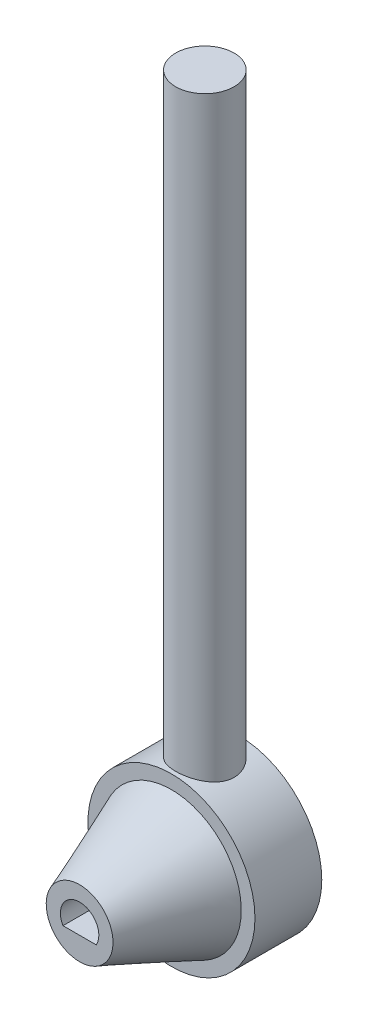
ISO-10303-21;
HEADER;
FILE_DESCRIPTION(('STEP AP214'),'2;1');
FILE_NAME('part.step','',(''),(''),'','','');
FILE_SCHEMA(('AUTOMOTIVE_DESIGN { 1 0 10303 214 1 1 1 1 }'));
ENDSEC;
DATA;
#1=APPLICATION_CONTEXT('core data for automotive mechanical design processes');
#2=APPLICATION_PROTOCOL_DEFINITION('international standard','automotive_design',2000,#1);
#3=PRODUCT_CONTEXT('',#1,'mechanical');
#4=PRODUCT('Part','Part','',(#3));
#5=PRODUCT_RELATED_PRODUCT_CATEGORY('part','',(#4));
#6=PRODUCT_DEFINITION_FORMATION('','',#4);
#7=PRODUCT_DEFINITION_CONTEXT('part definition',#1,'design');
#8=PRODUCT_DEFINITION('design','',#6,#7);
#9=PRODUCT_DEFINITION_SHAPE('','',#8);
#10=(LENGTH_UNIT() NAMED_UNIT(*) SI_UNIT(.MILLI.,.METRE.));
#11=(NAMED_UNIT(*) PLANE_ANGLE_UNIT() SI_UNIT($,.RADIAN.));
#12=(NAMED_UNIT(*) SI_UNIT($,.STERADIAN.) SOLID_ANGLE_UNIT());
#13=UNCERTAINTY_MEASURE_WITH_UNIT(LENGTH_MEASURE(1.E-05),#10,'distance_accuracy_value','');
#14=(GEOMETRIC_REPRESENTATION_CONTEXT(3) GLOBAL_UNCERTAINTY_ASSIGNED_CONTEXT((#13)) GLOBAL_UNIT_ASSIGNED_CONTEXT((#10,
#11,#12)) REPRESENTATION_CONTEXT('',''));
#15=CARTESIAN_POINT('',(0.,0.,0.));
#16=DIRECTION('',(0.,0.,1.));
#17=DIRECTION('',(1.,0.,0.));
#18=AXIS2_PLACEMENT_3D('',#15,#16,#17);
#19=CARTESIAN_POINT('',(0.,90.,0.));
#20=DIRECTION('',(0.,-1.,0.));
#21=DIRECTION('',(0.,0.,-1.));
#22=AXIS2_PLACEMENT_3D('',#19,#20,#21);
#23=CYLINDRICAL_SURFACE('',#22,3.5);
#24=CARTESIAN_POINT('',(0.,90.,0.));
#25=DIRECTION('',(0.,1.,0.));
#26=DIRECTION('',(0.,0.,1.));
#27=AXIS2_PLACEMENT_3D('',#24,#25,#26);
#28=CIRCLE('',#27,3.5);
#29=CARTESIAN_POINT('',(0.,90.,3.5));
#30=VERTEX_POINT('',#29);
#31=EDGE_CURVE('E137',#30,#30,#28,.T.);
#32=ORIENTED_EDGE('',*,*,#31,.F.);
#33=EDGE_LOOP('',(#32));
#34=FACE_BOUND('',#33,.T.);
#35=CARTESIAN_POINT('',(3.5,18.3674969975976,0.));
#36=CARTESIAN_POINT('',(3.49999931876293,18.3674974163581,0.0949125445487518));
#37=CARTESIAN_POINT('',(3.49613335325264,18.3689450925432,0.189827733414717));
#38=CARTESIAN_POINT('',(3.48072025667604,18.3746808559934,0.378954929942532));
#39=CARTESIAN_POINT('',(3.46917030321874,18.3789699869454,0.473166666357867));
#40=CARTESIAN_POINT('',(3.42308456090508,18.3959384206346,0.753922053444382));
#41=CARTESIAN_POINT('',(3.3771130257858,18.4127185574715,0.938482679515707));
#42=CARTESIAN_POINT('',(3.25660142901521,18.4550802797245,1.29620574896545));
#43=CARTESIAN_POINT('',(3.18214019853367,18.4806375589245,1.46939811280679));
#44=CARTESIAN_POINT('',(3.00699224393094,18.5376336459777,1.8008678718889));
#45=CARTESIAN_POINT('',(2.90630701540706,18.569072118388,1.95914611700533));
#46=CARTESIAN_POINT('',(2.67688564764853,18.6358225235968,2.26317720861855));
#47=CARTESIAN_POINT('',(2.54720110491909,18.6712382320074,2.40819147403998));
#48=CARTESIAN_POINT('',(2.2654765222467,18.7410808991136,2.67493099739407));
#49=CARTESIAN_POINT('',(2.11343139872121,18.7755076308365,2.79665094494343));
#50=CARTESIAN_POINT('',(1.78584991632491,18.8407006035732,3.01675048103769));
#51=CARTESIAN_POINT('',(1.60975902782438,18.8713312920524,3.11434843953507));
#52=CARTESIAN_POINT('',(1.24240084860165,18.9242536724353,3.27823977332488));
#53=CARTESIAN_POINT('',(1.05113816356763,18.946547883382,3.34454260669185));
#54=CARTESIAN_POINT('',(0.666588873402089,18.9795523447277,3.44143359484431));
#55=CARTESIAN_POINT('',(0.473656222959584,18.9906711074492,3.47328476251692));
#56=CARTESIAN_POINT('',(0.0848855770757777,19.0015281482889,3.50439616107746));
#57=CARTESIAN_POINT('',(-0.110951578274,19.001269655351,3.50366563887367));
#58=CARTESIAN_POINT('',(-0.490988185550729,18.9896716618838,3.47041045325108));
#59=CARTESIAN_POINT('',(-0.675324978968535,18.9788111922274,3.43926022663317));
#60=CARTESIAN_POINT('',(-1.03596787992006,18.9478412300132,3.34833704725335));
#61=CARTESIAN_POINT('',(-1.21227340064587,18.9277310628101,3.28856200667053));
#62=CARTESIAN_POINT('',(-1.55471880066635,18.8799381735561,3.14134942844472));
#63=CARTESIAN_POINT('',(-1.72068479372725,18.8521547684702,3.05354148905649));
#64=CARTESIAN_POINT('',(-2.03590938344228,18.791877409622,2.85306499815619));
#65=CARTESIAN_POINT('',(-2.18516381692522,18.7593822866869,2.74039027252758));
#66=CARTESIAN_POINT('',(-2.47085266041279,18.6911078532,2.48661691576681));
#67=CARTESIAN_POINT('',(-2.60623320305309,18.6552455874217,2.34435462295479));
#68=CARTESIAN_POINT('',(-2.85166653148397,18.5856309669504,2.03871855007066));
#69=CARTESIAN_POINT('',(-2.96170630774453,18.551879702458,1.87533399308184));
#70=CARTESIAN_POINT('',(-3.10615110190286,18.5054953965972,1.61613336808647));
#71=CARTESIAN_POINT('',(-3.15118056912875,18.4906240557175,1.52648340753314));
#72=CARTESIAN_POINT('',(-3.23347084778299,18.4629040138808,1.34339922032142));
#73=CARTESIAN_POINT('',(-3.27073492418945,18.4500544634159,1.24996660390456));
#74=CARTESIAN_POINT('',(-3.33709936439097,18.4268236156629,1.06012560819917));
#75=CARTESIAN_POINT('',(-3.36621302024361,18.416438303855,0.963722362006856));
#76=CARTESIAN_POINT('',(-3.41605853619604,18.3984704797763,0.768557216860319));
#77=CARTESIAN_POINT('',(-3.43679422950909,18.3908866858486,0.669796418525072));
#78=CARTESIAN_POINT('',(-3.46877041331216,18.379120718024,0.476156346132637));
#79=CARTESIAN_POINT('',(-3.48047090109223,18.37477422283,0.381362811146862));
#80=CARTESIAN_POINT('',(-3.49608605186955,18.368962146477,0.191047078779583));
#81=CARTESIAN_POINT('',(-3.50000068563212,18.3674965761354,0.0955248786634047));
#82=CARTESIAN_POINT('',(-3.49999931876293,18.3674974163581,-0.0949125445487516));
#83=CARTESIAN_POINT('',(-3.49613335325264,18.3689450925432,-0.189827733414716));
#84=CARTESIAN_POINT('',(-3.48072025667604,18.3746808559934,-0.378954929942532));
#85=CARTESIAN_POINT('',(-3.46917030321874,18.3789699869454,-0.473166666357867));
#86=CARTESIAN_POINT('',(-3.42308456090508,18.3959384206346,-0.753922053444383));
#87=CARTESIAN_POINT('',(-3.3771130257858,18.4127185574715,-0.938482679515707));
#88=CARTESIAN_POINT('',(-3.25660142901521,18.4550802797245,-1.29620574896545));
#89=CARTESIAN_POINT('',(-3.18214019853367,18.4806375589245,-1.46939811280679));
#90=CARTESIAN_POINT('',(-3.00699224393094,18.5376336459777,-1.8008678718889));
#91=CARTESIAN_POINT('',(-2.90630701540706,18.569072118388,-1.95914611700533));
#92=CARTESIAN_POINT('',(-2.67688564764853,18.6358225235968,-2.26317720861855));
#93=CARTESIAN_POINT('',(-2.54720110491909,18.6712382320074,-2.40819147403998));
#94=CARTESIAN_POINT('',(-2.2654765222467,18.7410808991136,-2.67493099739407));
#95=CARTESIAN_POINT('',(-2.11343139872121,18.7755076308365,-2.79665094494343));
#96=CARTESIAN_POINT('',(-1.78584991632491,18.8407006035732,-3.01675048103769));
#97=CARTESIAN_POINT('',(-1.60975902782438,18.8713312920524,-3.11434843953507));
#98=CARTESIAN_POINT('',(-1.24240084860165,18.9242536724353,-3.27823977332488));
#99=CARTESIAN_POINT('',(-1.05113816356763,18.946547883382,-3.34454260669185));
#100=CARTESIAN_POINT('',(-0.666588873402089,18.9795523447277,-3.44143359484431));
#101=CARTESIAN_POINT('',(-0.473656222959583,18.9906711074492,-3.47328476251692));
#102=CARTESIAN_POINT('',(-0.0848855770757767,19.0015281482889,-3.50439616107746));
#103=CARTESIAN_POINT('',(0.110951578274001,19.001269655351,-3.50366563887367));
#104=CARTESIAN_POINT('',(0.490988185550729,18.9896716618838,-3.47041045325108));
#105=CARTESIAN_POINT('',(0.675324978968537,18.9788111922274,-3.43926022663317));
#106=CARTESIAN_POINT('',(1.03596787992007,18.9478412300132,-3.34833704725335));
#107=CARTESIAN_POINT('',(1.21227340064587,18.9277310628101,-3.28856200667053));
#108=CARTESIAN_POINT('',(1.55471880066635,18.8799381735561,-3.14134942844472));
#109=CARTESIAN_POINT('',(1.72068479372725,18.8521547684702,-3.05354148905649));
#110=CARTESIAN_POINT('',(2.03590938344228,18.791877409622,-2.85306499815618));
#111=CARTESIAN_POINT('',(2.18516381692522,18.7593822866869,-2.74039027252758));
#112=CARTESIAN_POINT('',(2.47085266041279,18.6911078532,-2.48661691576682));
#113=CARTESIAN_POINT('',(2.60623320305308,18.6552455874217,-2.34435462295479));
#114=CARTESIAN_POINT('',(2.85166653148397,18.5856309669504,-2.03871855007066));
#115=CARTESIAN_POINT('',(2.96170630774453,18.551879702458,-1.87533399308184));
#116=CARTESIAN_POINT('',(3.10615110190286,18.5054953965972,-1.61613336808647));
#117=CARTESIAN_POINT('',(3.15118056912875,18.4906240557175,-1.52648340753314));
#118=CARTESIAN_POINT('',(3.23347084778299,18.4629040138808,-1.34339922032142));
#119=CARTESIAN_POINT('',(3.27073492418945,18.4500544634159,-1.24996660390456));
#120=CARTESIAN_POINT('',(3.33709936439097,18.4268236156629,-1.06012560819917));
#121=CARTESIAN_POINT('',(3.36621302024361,18.416438303855,-0.963722362006855));
#122=CARTESIAN_POINT('',(3.41605853619604,18.3984704797763,-0.768557216860318));
#123=CARTESIAN_POINT('',(3.43679422950909,18.3908866858487,-0.669796418525071));
#124=CARTESIAN_POINT('',(3.46877041331216,18.3791207180239,-0.476156346132637));
#125=CARTESIAN_POINT('',(3.48047090109223,18.37477422283,-0.381362811146862));
#126=CARTESIAN_POINT('',(3.49608605186955,18.368962146477,-0.191047078779582));
#127=CARTESIAN_POINT('',(3.50000068563212,18.3674965761354,-0.0955248786634045));
#128=CARTESIAN_POINT('',(3.5,18.3674969975976,0.));
#129=B_SPLINE_CURVE_WITH_KNOTS('',3,(#35,#36,#37,#38,#39,#40,#41,#42,#43,#44,#45,#46,#47,#48,
#49,#50,#51,#52,#53,#54,#55,#56,#57,#58,#59,#60,#61,#62,#63,#64,#65,#66,#67,#68,#69,#70,#71,#72,
#73,#74,#75,#76,#77,#78,#79,#80,#81,#82,#83,#84,#85,#86,#87,#88,#89,#90,#91,#92,#93,#94,#95,#96,
#97,#98,#99,#100,#101,#102,#103,#104,#105,#106,#107,#108,#109,#110,#111,#112,#113,#114,#115,
#116,#117,#118,#119,#120,#121,#122,#123,#124,#125,#126,#127,#128),.UNSPECIFIED.,.T.,.F.,(4,2,2,
2,2,2,2,2,2,2,2,2,2,2,2,2,2,2,2,2,2,2,2,2,2,2,2,2,2,2,2,2,2,2,2,2,2,2,2,2,2,2,2,2,2,2,4),(0.,
0.284642016105157,0.569388641293585,1.13918738851407,1.70742076956042,2.2756217504256,
2.86619565394675,3.45690403007573,4.06478943625891,4.67249100829415,5.25706829163205,
5.8414796689613,6.40065242591722,6.95986597372056,7.52679758954604,8.09387012618269,
8.69010214839508,9.2866395872469,9.59057721468944,9.89438679179854,10.1976979778488,
10.5008702307562,10.7873475566466,11.0738259582132,11.3584679743184,11.6432145995068,
12.2130133467273,12.7812467277737,13.3494477086388,13.94002161216,14.530729988289,
15.1386153944721,15.7463169665074,16.3308942498453,16.9153056271745,17.4744783841305,
18.0336919319338,18.6006235477593,19.1676960843959,19.7639281066083,20.3604655454601,
20.6644031729027,20.9682127500118,21.271523936062,21.5746961889695,21.8611735148598,
22.1476519164265),.UNSPECIFIED.);
#130=CARTESIAN_POINT('',(3.5,18.3674969975976,0.));
#131=VERTEX_POINT('',#130);
#132=EDGE_CURVE('E40',#131,#131,#129,.T.);
#133=ORIENTED_EDGE('',*,*,#132,.F.);
#134=EDGE_LOOP('',(#133));
#135=FACE_BOUND('',#134,.T.);
#136=ADVANCED_FACE('F36',(#34,#135),#23,.T.);
#137=CARTESIAN_POINT('',(0.,90.,0.));
#138=DIRECTION('',(0.,1.,0.));
#139=DIRECTION('',(0.,0.,1.));
#140=AXIS2_PLACEMENT_3D('',#137,#138,#139);
#141=PLANE('',#140);
#142=ORIENTED_EDGE('',*,*,#31,.T.);
#143=EDGE_LOOP('',(#142));
#144=FACE_BOUND('',#143,.T.);
#145=ADVANCED_FACE('F148',(#144),#141,.T.);
#146=CARTESIAN_POINT('',(0.,9.,4.));
#147=DIRECTION('',(0.,0.,-1.));
#148=DIRECTION('',(-1.,0.,0.));
#149=AXIS2_PLACEMENT_3D('',#146,#147,#148);
#150=CYLINDRICAL_SURFACE('',#149,10.);
#151=CARTESIAN_POINT('',(0.,9.,4.));
#152=DIRECTION('',(0.,0.,1.));
#153=DIRECTION('',(1.,0.,0.));
#154=AXIS2_PLACEMENT_3D('',#151,#152,#153);
#155=CIRCLE('',#154,10.);
#156=CARTESIAN_POINT('',(10.,9.,4.));
#157=VERTEX_POINT('',#156);
#158=EDGE_CURVE('E134',#157,#157,#155,.T.);
#159=ORIENTED_EDGE('',*,*,#158,.F.);
#160=EDGE_LOOP('',(#159));
#161=FACE_BOUND('',#160,.T.);
#162=ORIENTED_EDGE('',*,*,#132,.T.);
#163=EDGE_LOOP('',(#162));
#164=FACE_BOUND('',#163,.T.);
#165=CARTESIAN_POINT('',(0.,9.,-4.));
#166=DIRECTION('',(0.,0.,1.));
#167=DIRECTION('',(1.,0.,0.));
#168=AXIS2_PLACEMENT_3D('',#165,#166,#167);
#169=CIRCLE('',#168,10.);
#170=CARTESIAN_POINT('',(10.,9.,-4.));
#171=VERTEX_POINT('',#170);
#172=EDGE_CURVE('E129',#171,#171,#169,.T.);
#173=ORIENTED_EDGE('',*,*,#172,.T.);
#174=EDGE_LOOP('',(#173));
#175=FACE_BOUND('',#174,.T.);
#176=ADVANCED_FACE('F144',(#161,#164,#175),#150,.T.);
#177=CARTESIAN_POINT('',(0.,9.,4.));
#178=DIRECTION('',(0.,0.,1.));
#179=DIRECTION('',(1.,0.,0.));
#180=AXIS2_PLACEMENT_3D('',#177,#178,#179);
#181=PLANE('',#180);
#182=CARTESIAN_POINT('',(0.,9.,4.));
#183=DIRECTION('',(0.,0.,1.));
#184=DIRECTION('',(1.,0.,0.));
#185=AXIS2_PLACEMENT_3D('',#182,#183,#184);
#186=CIRCLE('',#185,8.35855926568982);
#187=CARTESIAN_POINT('',(-8.3533591605789,9.29479439007853,4.));
#188=VERTEX_POINT('',#187);
#189=EDGE_CURVE('E12',#188,#188,#186,.T.);
#190=ORIENTED_EDGE('',*,*,#189,.F.);
#191=EDGE_LOOP('',(#190));
#192=FACE_BOUND('',#191,.T.);
#193=ORIENTED_EDGE('',*,*,#158,.T.);
#194=EDGE_LOOP('',(#193));
#195=FACE_BOUND('',#194,.T.);
#196=ADVANCED_FACE('F156',(#192,#195),#181,.T.);
#197=CARTESIAN_POINT('',(0.,9.,-4.));
#198=DIRECTION('',(0.,0.,1.));
#199=DIRECTION('',(1.,0.,0.));
#200=AXIS2_PLACEMENT_3D('',#197,#198,#199);
#201=PLANE('',#200);
#202=ORIENTED_EDGE('',*,*,#172,.F.);
#203=EDGE_LOOP('',(#202));
#204=FACE_BOUND('',#203,.T.);
#205=ADVANCED_FACE('F118',(#204),#201,.F.);
#206=CARTESIAN_POINT('',(0.,9.,15.));
#207=DIRECTION('',(0.,0.,1.));
#208=DIRECTION('',(1.,0.,0.));
#209=AXIS2_PLACEMENT_3D('',#206,#207,#208);
#210=PLANE('',#209);
#211=CARTESIAN_POINT('',(0.,8.90005068199067,15.));
#212=DIRECTION('',(0.,0.,1.));
#213=DIRECTION('',(1.,0.,0.));
#214=AXIS2_PLACEMENT_3D('',#211,#212,#213);
#215=CIRCLE('',#214,2.3);
#216=CARTESIAN_POINT('',(1.99219481952629,7.75063352488337,15.));
#217=VERTEX_POINT('',#216);
#218=CARTESIAN_POINT('',(-1.99219481952629,7.75063352488337,15.));
#219=VERTEX_POINT('',#218);
#220=EDGE_CURVE('E55',#217,#219,#215,.T.);
#221=ORIENTED_EDGE('',*,*,#220,.F.);
#222=DIRECTION('',(-1.,0.,0.));
#223=VECTOR('',#222,1.);
#224=CARTESIAN_POINT('',(1.99219481952629,7.75063352488337,15.));
#225=LINE('',#224,#223);
#226=EDGE_CURVE('E75',#217,#219,#225,.T.);
#227=ORIENTED_EDGE('',*,*,#226,.T.);
#228=EDGE_LOOP('',(#221,#227));
#229=FACE_BOUND('',#228,.T.);
#230=CARTESIAN_POINT('',(0.,9.,15.));
#231=DIRECTION('',(0.,0.,1.));
#232=DIRECTION('',(1.,0.,0.));
#233=AXIS2_PLACEMENT_3D('',#230,#231,#232);
#234=CIRCLE('',#233,4.);
#235=CARTESIAN_POINT('',(-3.89810749114631,8.10291695620248,15.));
#236=VERTEX_POINT('',#235);
#237=EDGE_CURVE('E71',#236,#236,#234,.T.);
#238=ORIENTED_EDGE('',*,*,#237,.T.);
#239=EDGE_LOOP('',(#238));
#240=FACE_BOUND('',#239,.T.);
#241=ADVANCED_FACE('F79',(#229,#240),#210,.T.);
#242=CARTESIAN_POINT('',(-9.9734506767362,9.72820436603346,0.));
#243=CARTESIAN_POINT('',(-3.89810749114631,8.10291695620248,15.));
#244=CARTESIAN_POINT('',(-11.4298594088031,-10.2186969874389,0.));
#245=CARTESIAN_POINT('',(-2.10394140355126,0.306701973909855,15.));
#246=CARTESIAN_POINT('',(8.51704194466928,-11.6751057195059,0.));
#247=CARTESIAN_POINT('',(5.69227357874136,2.1008680615049,15.));
#248=CARTESIAN_POINT('',(9.9734506767362,8.27179563396654,0.));
#249=CARTESIAN_POINT('',(3.89810749114631,9.89708304379752,15.));
#250=CARTESIAN_POINT('',(11.4298594088031,28.2186969874389,0.));
#251=CARTESIAN_POINT('',(2.10394140355126,17.6932980260901,15.));
#252=CARTESIAN_POINT('',(-8.51704194466928,29.6751057195059,0.));
#253=CARTESIAN_POINT('',(-5.69227357874136,15.8991319384951,15.));
#254=CARTESIAN_POINT('',(-9.9734506767362,9.72820436603346,0.));
#255=CARTESIAN_POINT('',(-3.89810749114631,8.10291695620248,15.));
#256=(BOUNDED_SURFACE() B_SPLINE_SURFACE(3,1,((#242,#243),(#244,#245),(#246,#247),(#248,#249),
(#250,#251),(#252,#253),(#254,#255)),.UNSPECIFIED.,.T.,.F.,.F.) B_SPLINE_SURFACE_WITH_KNOTS((4,
3,4),(2,2),(0.,0.5,1.),(0.,1.),
.UNSPECIFIED.) GEOMETRIC_REPRESENTATION_ITEM() RATIONAL_B_SPLINE_SURFACE(((1.,1.),
(0.333333333333333,0.333333333333333),(0.333333333333333,0.333333333333333),(1.,1.),
(0.333333333333333,0.333333333333333),(0.333333333333333,0.333333333333333),(1.,1.))) REPRESENTATION_ITEM('') SURFACE());
#257=CARTESIAN_POINT('',(-8.3533591605789,9.29479439007853,4.));
#258=CARTESIAN_POINT('',(-8.30695028902231,9.28237900014232,4.11458333333333));
#259=CARTESIAN_POINT('',(-8.26054141746572,9.26996361020611,4.22916666666667));
#260=CARTESIAN_POINT('',(-8.16772367435254,9.24513283033369,4.45833333333333));
#261=CARTESIAN_POINT('',(-8.12131480279595,9.23271744039748,4.57291666666667));
#262=CARTESIAN_POINT('',(-8.02849705968277,9.20788666052507,4.80208333333333));
#263=CARTESIAN_POINT('',(-7.98208818812618,9.19547127058886,4.91666666666667));
#264=CARTESIAN_POINT('',(-7.889270445013,9.17064049071644,5.14583333333333));
#265=CARTESIAN_POINT('',(-7.84286157345641,9.15822510078023,5.26041666666667));
#266=CARTESIAN_POINT('',(-7.75004383034323,9.13339432090781,5.48958333333333));
#267=CARTESIAN_POINT('',(-7.70363495878665,9.1209789309716,5.60416666666667));
#268=CARTESIAN_POINT('',(-7.61081721567347,9.09614815109919,5.83333333333333));
#269=CARTESIAN_POINT('',(-7.56440834411688,9.08373276116298,5.94791666666667));
#270=CARTESIAN_POINT('',(-7.4715906010037,9.05890198129056,6.17708333333333));
#271=CARTESIAN_POINT('',(-7.42518172944711,9.04648659135435,6.29166666666667));
#272=CARTESIAN_POINT('',(-7.33236398633393,9.02165581148193,6.52083333333333));
#273=CARTESIAN_POINT('',(-7.28595511477734,9.00924042154572,6.63541666666667));
#274=CARTESIAN_POINT('',(-7.19313737166416,8.98440964167331,6.86458333333333));
#275=CARTESIAN_POINT('',(-7.14672850010757,8.9719942517371,6.97916666666667));
#276=CARTESIAN_POINT('',(-7.05391075699439,8.94716347186468,7.20833333333333));
#277=CARTESIAN_POINT('',(-7.0075018854378,8.93474808192847,7.32291666666667));
#278=CARTESIAN_POINT('',(-6.91468414232462,8.90991730205605,7.55208333333333));
#279=CARTESIAN_POINT('',(-6.86827527076803,8.89750191211984,7.66666666666667));
#280=CARTESIAN_POINT('',(-6.77545752765486,8.87267113224743,7.89583333333333));
#281=CARTESIAN_POINT('',(-6.72904865609827,8.86025574231122,8.01041666666667));
#282=CARTESIAN_POINT('',(-6.63623091298509,8.8354249624388,8.23958333333333));
#283=CARTESIAN_POINT('',(-6.5898220414285,8.82300957250259,8.35416666666667));
#284=CARTESIAN_POINT('',(-6.49700429831532,8.79817879263017,8.58333333333333));
#285=CARTESIAN_POINT('',(-6.45059542675873,8.78576340269396,8.69791666666667));
#286=CARTESIAN_POINT('',(-6.35777768364555,8.76093262282155,8.92708333333333));
#287=CARTESIAN_POINT('',(-6.31136881208896,8.74851723288534,9.04166666666667));
#288=CARTESIAN_POINT('',(-6.21855106897578,8.72368645301292,9.27083333333333));
#289=CARTESIAN_POINT('',(-6.17214219741919,8.71127106307671,9.38541666666667));
#290=CARTESIAN_POINT('',(-6.07932445430601,8.68644028320429,9.61458333333333));
#291=CARTESIAN_POINT('',(-6.03291558274942,8.67402489326808,9.72916666666667));
#292=CARTESIAN_POINT('',(-5.94009783963625,8.64919411339567,9.95833333333333));
#293=CARTESIAN_POINT('',(-5.89368896807965,8.63677872345946,10.0729166666667));
#294=CARTESIAN_POINT('',(-5.80087122496648,8.61194794358704,10.3020833333333));
#295=CARTESIAN_POINT('',(-5.75446235340989,8.59953255365083,10.4166666666667));
#296=CARTESIAN_POINT('',(-5.66164461029671,8.57470177377841,10.6458333333333));
#297=CARTESIAN_POINT('',(-5.61523573874012,8.5622863838422,10.7604166666667));
#298=CARTESIAN_POINT('',(-5.52241799562694,8.53745560396979,10.9895833333333));
#299=CARTESIAN_POINT('',(-5.47600912407035,8.52504021403358,11.1041666666667));
#300=CARTESIAN_POINT('',(-5.38319138095717,8.50020943416116,11.3333333333333));
#301=CARTESIAN_POINT('',(-5.33678250940058,8.48779404422495,11.4479166666667));
#302=CARTESIAN_POINT('',(-5.2439647662874,8.46296326435253,11.6770833333333));
#303=CARTESIAN_POINT('',(-5.19755589473081,8.45054787441632,11.7916666666667));
#304=CARTESIAN_POINT('',(-5.10473815161764,8.42571709454391,12.0208333333333));
#305=CARTESIAN_POINT('',(-5.05832928006105,8.4133017046077,12.1354166666667));
#306=CARTESIAN_POINT('',(-4.96551153694787,8.38847092473528,12.3645833333333));
#307=CARTESIAN_POINT('',(-4.91910266539128,8.37605553479907,12.4791666666667));
#308=CARTESIAN_POINT('',(-4.8262849222781,8.35122475492665,12.7083333333333));
#309=CARTESIAN_POINT('',(-4.77987605072151,8.33880936499044,12.8229166666667));
#310=CARTESIAN_POINT('',(-4.68705830760833,8.31397858511803,13.0520833333333));
#311=CARTESIAN_POINT('',(-4.64064943605174,8.30156319518182,13.1666666666667));
#312=CARTESIAN_POINT('',(-4.54783169293856,8.2767324153094,13.3958333333333));
#313=CARTESIAN_POINT('',(-4.50142282138197,8.26431702537319,13.5104166666667));
#314=CARTESIAN_POINT('',(-4.40860507826879,8.23948624550077,13.7395833333333));
#315=CARTESIAN_POINT('',(-4.3621962067122,8.22707085556456,13.8541666666667));
#316=CARTESIAN_POINT('',(-4.26937846359902,8.20224007569215,14.0833333333333));
#317=CARTESIAN_POINT('',(-4.22296959204244,8.18982468575594,14.1979166666667));
#318=CARTESIAN_POINT('',(-4.13015184892926,8.16499390588352,14.4270833333333));
#319=CARTESIAN_POINT('',(-4.08374297737267,8.15257851594731,14.5416666666667));
#320=CARTESIAN_POINT('',(-3.99092523425949,8.12774773607489,14.7708333333333));
#321=CARTESIAN_POINT('',(-3.9445163627029,8.11533234613868,14.8854166666667));
#322=CARTESIAN_POINT('',(-3.89810749114631,8.10291695620248,15.));
#323=B_SPLINE_CURVE_WITH_KNOTS('',3,(#257,#258,#259,#260,#261,#262,#263,#264,#265,#266,#267,
#268,#269,#270,#271,#272,#273,#274,#275,#276,#277,#278,#279,#280,#281,#282,#283,#284,#285,#286,
#287,#288,#289,#290,#291,#292,#293,#294,#295,#296,#297,#298,#299,#300,#301,#302,#303,#304,#305,
#306,#307,#308,#309,#310,#311,#312,#313,#314,#315,#316,#317,#318,#319,#320,#321,#322),
.UNSPECIFIED.,.F.,.F.,(4,2,2,2,2,2,2,2,2,2,2,2,2,2,2,2,2,2,2,2,2,2,2,2,2,2,2,2,2,2,2,2,4),(0.,
0.372740378679071,0.745480757358142,1.11822113603721,1.49096151471628,1.86370189339535,
2.23644227207443,2.6091826507535,2.98192302943257,3.35466340811164,3.72740378679071,
4.10014416546978,4.47288454414885,4.84562492282792,5.21836530150699,5.59110568018606,
5.96384605886513,6.33658643754421,6.70932681622328,7.08206719490235,7.45480757358142,
7.82754795226049,8.20028833093956,8.57302870961863,8.9457690882977,9.31850946697677,
9.69124984565584,10.0639902243349,10.436730603014,10.8094709816931,11.1822113603721,
11.5549517390512,11.9276921177303),.UNSPECIFIED.);
#324=EDGE_CURVE('BSEAM96',#188,#236,#323,.T.);
#325=ORIENTED_EDGE('',*,*,#189,.T.);
#326=ORIENTED_EDGE('',*,*,#237,.F.);
#327=ORIENTED_EDGE('',*,*,#324,.T.);
#328=ORIENTED_EDGE('',*,*,#324,.F.);
#329=EDGE_LOOP('',(#325,#327,#326,#328));
#330=FACE_BOUND('',#329,.T.);
#331=ADVANCED_FACE('F96',(#330),#256,.T.);
#332=CARTESIAN_POINT('',(0.,8.90005068199067,8.5));
#333=DIRECTION('',(0.,0.,1.));
#334=DIRECTION('',(1.,0.,0.));
#335=AXIS2_PLACEMENT_3D('',#332,#333,#334);
#336=CYLINDRICAL_SURFACE('',#335,2.3);
#337=ORIENTED_EDGE('',*,*,#220,.T.);
#338=DIRECTION('',(0.,0.,1.));
#339=VECTOR('',#338,1.);
#340=CARTESIAN_POINT('',(-1.99219481952629,7.75063352488337,8.5));
#341=LINE('',#340,#339);
#342=CARTESIAN_POINT('',(-1.99219481952629,7.75063352488337,8.5));
#343=VERTEX_POINT('',#342);
#344=EDGE_CURVE('E72',#343,#219,#341,.T.);
#345=ORIENTED_EDGE('',*,*,#344,.F.);
#346=CARTESIAN_POINT('',(0.,8.90005068199067,8.5));
#347=DIRECTION('',(0.,0.,1.));
#348=DIRECTION('',(1.,0.,0.));
#349=AXIS2_PLACEMENT_3D('',#346,#347,#348);
#350=CIRCLE('',#349,2.3);
#351=CARTESIAN_POINT('',(1.99219481952629,7.75063352488337,8.5));
#352=VERTEX_POINT('',#351);
#353=EDGE_CURVE('E70',#352,#343,#350,.T.);
#354=ORIENTED_EDGE('',*,*,#353,.F.);
#355=DIRECTION('',(0.,0.,1.));
#356=VECTOR('',#355,1.);
#357=CARTESIAN_POINT('',(1.99219481952629,7.75063352488337,8.5));
#358=LINE('',#357,#356);
#359=EDGE_CURVE('E63',#352,#217,#358,.T.);
#360=ORIENTED_EDGE('',*,*,#359,.T.);
#361=EDGE_LOOP('',(#337,#345,#354,#360));
#362=FACE_BOUND('',#361,.T.);
#363=ADVANCED_FACE('F68',(#362),#336,.F.);
#364=CARTESIAN_POINT('',(1.99219481952629,7.75063352488337,8.5));
#365=DIRECTION('',(0.,1.,0.));
#366=DIRECTION('',(-1.,0.,0.));
#367=AXIS2_PLACEMENT_3D('',#364,#365,#366);
#368=PLANE('',#367);
#369=ORIENTED_EDGE('',*,*,#226,.F.);
#370=ORIENTED_EDGE('',*,*,#359,.F.);
#371=DIRECTION('',(-1.,0.,0.));
#372=VECTOR('',#371,1.);
#373=CARTESIAN_POINT('',(1.99219481952629,7.75063352488337,8.5));
#374=LINE('',#373,#372);
#375=EDGE_CURVE('E83',#352,#343,#374,.T.);
#376=ORIENTED_EDGE('',*,*,#375,.T.);
#377=ORIENTED_EDGE('',*,*,#344,.T.);
#378=EDGE_LOOP('',(#369,#370,#376,#377));
#379=FACE_BOUND('',#378,.T.);
#380=ADVANCED_FACE('F76',(#379),#368,.T.);
#381=CARTESIAN_POINT('',(0.,8.90005068199067,8.5));
#382=DIRECTION('',(0.,0.,1.));
#383=DIRECTION('',(1.,0.,0.));
#384=AXIS2_PLACEMENT_3D('',#381,#382,#383);
#385=PLANE('',#384);
#386=ORIENTED_EDGE('',*,*,#353,.T.);
#387=ORIENTED_EDGE('',*,*,#375,.F.);
#388=EDGE_LOOP('',(#386,#387));
#389=FACE_BOUND('',#388,.T.);
#390=ADVANCED_FACE('F190',(#389),#385,.T.);
#391=CLOSED_SHELL('',(#136,#145,#176,#196,#205,#241,#331,#363,#380,#390));
#392=MANIFOLD_SOLID_BREP('B2',#391);
#393=ADVANCED_BREP_SHAPE_REPRESENTATION('',(#18,#392),#14);
#394=SHAPE_DEFINITION_REPRESENTATION(#9,#393);
ENDSEC;
END-ISO-10303-21;
